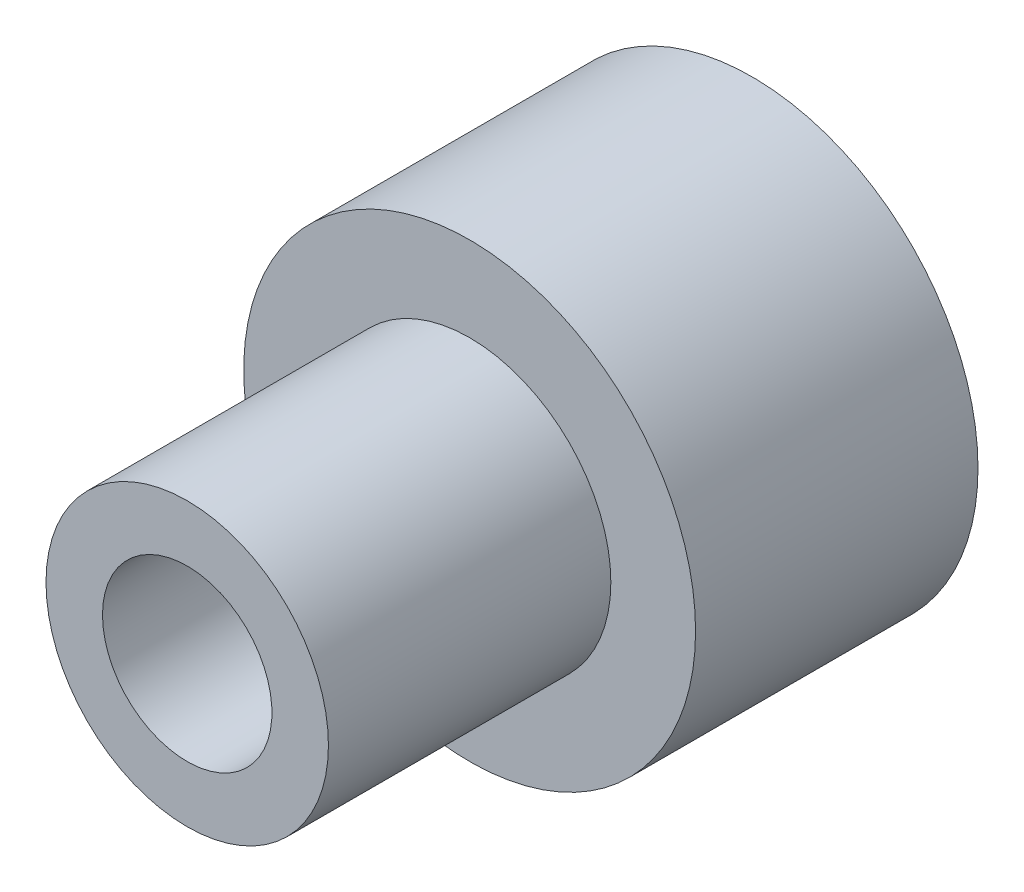
ISO-10303-21;
HEADER;
FILE_DESCRIPTION(('STEP AP214'),'2;1');
FILE_NAME('part.step','',(''),(''),'','','');
FILE_SCHEMA(('AUTOMOTIVE_DESIGN { 1 0 10303 214 1 1 1 1 }'));
ENDSEC;
DATA;
#1=APPLICATION_CONTEXT('core data for automotive mechanical design processes');
#2=APPLICATION_PROTOCOL_DEFINITION('international standard','automotive_design',2000,#1);
#3=PRODUCT_CONTEXT('',#1,'mechanical');
#4=PRODUCT('Part','Part','',(#3));
#5=PRODUCT_RELATED_PRODUCT_CATEGORY('part','',(#4));
#6=PRODUCT_DEFINITION_FORMATION('','',#4);
#7=PRODUCT_DEFINITION_CONTEXT('part definition',#1,'design');
#8=PRODUCT_DEFINITION('design','',#6,#7);
#9=PRODUCT_DEFINITION_SHAPE('','',#8);
#10=(LENGTH_UNIT() NAMED_UNIT(*) SI_UNIT(.MILLI.,.METRE.));
#11=(NAMED_UNIT(*) PLANE_ANGLE_UNIT() SI_UNIT($,.RADIAN.));
#12=(NAMED_UNIT(*) SI_UNIT($,.STERADIAN.) SOLID_ANGLE_UNIT());
#13=UNCERTAINTY_MEASURE_WITH_UNIT(LENGTH_MEASURE(1.E-05),#10,'distance_accuracy_value','');
#14=(GEOMETRIC_REPRESENTATION_CONTEXT(3) GLOBAL_UNCERTAINTY_ASSIGNED_CONTEXT((#13)) GLOBAL_UNIT_ASSIGNED_CONTEXT((#10,
#11,#12)) REPRESENTATION_CONTEXT('',''));
#15=CARTESIAN_POINT('',(0.,0.,0.));
#16=DIRECTION('',(0.,0.,1.));
#17=DIRECTION('',(1.,0.,0.));
#18=AXIS2_PLACEMENT_3D('',#15,#16,#17);
#19=CARTESIAN_POINT('',(0.,0.,5.));
#20=DIRECTION('',(0.,0.,-1.));
#21=DIRECTION('',(-1.,0.,0.));
#22=AXIS2_PLACEMENT_3D('',#19,#20,#21);
#23=CYLINDRICAL_SURFACE('',#22,4.);
#24=CARTESIAN_POINT('',(0.,0.,5.));
#25=DIRECTION('',(0.,0.,1.));
#26=DIRECTION('',(1.,0.,0.));
#27=AXIS2_PLACEMENT_3D('',#24,#25,#26);
#28=CIRCLE('',#27,4.);
#29=CARTESIAN_POINT('',(4.,0.,5.));
#30=VERTEX_POINT('',#29);
#31=EDGE_CURVE('E38',#30,#30,#28,.T.);
#32=ORIENTED_EDGE('',*,*,#31,.F.);
#33=EDGE_LOOP('',(#32));
#34=FACE_BOUND('',#33,.T.);
#35=CARTESIAN_POINT('',(0.,0.,0.));
#36=DIRECTION('',(0.,0.,1.));
#37=DIRECTION('',(1.,0.,0.));
#38=AXIS2_PLACEMENT_3D('',#35,#36,#37);
#39=CIRCLE('',#38,4.);
#40=CARTESIAN_POINT('',(4.,0.,0.));
#41=VERTEX_POINT('',#40);
#42=EDGE_CURVE('E34',#41,#41,#39,.T.);
#43=ORIENTED_EDGE('',*,*,#42,.T.);
#44=EDGE_LOOP('',(#43));
#45=FACE_BOUND('',#44,.T.);
#46=ADVANCED_FACE('F31',(#34,#45),#23,.T.);
#47=CARTESIAN_POINT('',(0.,0.,5.));
#48=DIRECTION('',(0.,0.,1.));
#49=DIRECTION('',(1.,0.,0.));
#50=AXIS2_PLACEMENT_3D('',#47,#48,#49);
#51=PLANE('',#50);
#52=CARTESIAN_POINT('',(0.,0.,5.));
#53=DIRECTION('',(0.,0.,1.));
#54=DIRECTION('',(1.,0.,0.));
#55=AXIS2_PLACEMENT_3D('',#52,#53,#54);
#56=CIRCLE('',#55,2.5);
#57=CARTESIAN_POINT('',(2.5,0.,5.));
#58=VERTEX_POINT('',#57);
#59=EDGE_CURVE('E10',#58,#58,#56,.T.);
#60=ORIENTED_EDGE('',*,*,#59,.F.);
#61=EDGE_LOOP('',(#60));
#62=FACE_BOUND('',#61,.T.);
#63=ORIENTED_EDGE('',*,*,#31,.T.);
#64=EDGE_LOOP('',(#63));
#65=FACE_BOUND('',#64,.T.);
#66=ADVANCED_FACE('F67',(#62,#65),#51,.T.);
#67=CARTESIAN_POINT('',(0.,0.,0.));
#68=DIRECTION('',(0.,0.,1.));
#69=DIRECTION('',(1.,0.,0.));
#70=AXIS2_PLACEMENT_3D('',#67,#68,#69);
#71=PLANE('',#70);
#72=CARTESIAN_POINT('',(0.,0.,0.));
#73=DIRECTION('',(0.,0.,-1.));
#74=DIRECTION('',(-1.,0.,0.));
#75=AXIS2_PLACEMENT_3D('',#72,#73,#74);
#76=CIRCLE('',#75,1.5);
#77=CARTESIAN_POINT('',(-1.5,0.,0.));
#78=VERTEX_POINT('',#77);
#79=EDGE_CURVE('E48',#78,#78,#76,.T.);
#80=ORIENTED_EDGE('',*,*,#79,.F.);
#81=EDGE_LOOP('',(#80));
#82=FACE_BOUND('',#81,.T.);
#83=ORIENTED_EDGE('',*,*,#42,.F.);
#84=EDGE_LOOP('',(#83));
#85=FACE_BOUND('',#84,.T.);
#86=ADVANCED_FACE('F63',(#82,#85),#71,.F.);
#87=CARTESIAN_POINT('',(0.,0.,10.));
#88=DIRECTION('',(0.,0.,-1.));
#89=DIRECTION('',(-1.,0.,0.));
#90=AXIS2_PLACEMENT_3D('',#87,#88,#89);
#91=CYLINDRICAL_SURFACE('',#90,2.5);
#92=CARTESIAN_POINT('',(0.,0.,10.));
#93=DIRECTION('',(0.,0.,1.));
#94=DIRECTION('',(1.,0.,0.));
#95=AXIS2_PLACEMENT_3D('',#92,#93,#94);
#96=CIRCLE('',#95,2.5);
#97=CARTESIAN_POINT('',(2.5,0.,10.));
#98=VERTEX_POINT('',#97);
#99=EDGE_CURVE('E44',#98,#98,#96,.T.);
#100=ORIENTED_EDGE('',*,*,#99,.F.);
#101=EDGE_LOOP('',(#100));
#102=FACE_BOUND('',#101,.T.);
#103=ORIENTED_EDGE('',*,*,#59,.T.);
#104=EDGE_LOOP('',(#103));
#105=FACE_BOUND('',#104,.T.);
#106=ADVANCED_FACE('F66',(#102,#105),#91,.T.);
#107=CARTESIAN_POINT('',(0.,0.,10.));
#108=DIRECTION('',(0.,0.,1.));
#109=DIRECTION('',(1.,0.,0.));
#110=AXIS2_PLACEMENT_3D('',#107,#108,#109);
#111=PLANE('',#110);
#112=CARTESIAN_POINT('',(0.,0.,10.));
#113=DIRECTION('',(0.,0.,-1.));
#114=DIRECTION('',(-1.,0.,0.));
#115=AXIS2_PLACEMENT_3D('',#112,#113,#114);
#116=CIRCLE('',#115,1.5);
#117=CARTESIAN_POINT('',(-1.5,0.,10.));
#118=VERTEX_POINT('',#117);
#119=EDGE_CURVE('E47',#118,#118,#116,.T.);
#120=ORIENTED_EDGE('',*,*,#119,.T.);
#121=EDGE_LOOP('',(#120));
#122=FACE_BOUND('',#121,.T.);
#123=ORIENTED_EDGE('',*,*,#99,.T.);
#124=EDGE_LOOP('',(#123));
#125=FACE_BOUND('',#124,.T.);
#126=ADVANCED_FACE('F54',(#122,#125),#111,.T.);
#127=CARTESIAN_POINT('',(0.,0.,10.));
#128=DIRECTION('',(0.,0.,-1.));
#129=DIRECTION('',(-1.,0.,0.));
#130=AXIS2_PLACEMENT_3D('',#127,#128,#129);
#131=CYLINDRICAL_SURFACE('',#130,1.5);
#132=ORIENTED_EDGE('',*,*,#119,.F.);
#133=EDGE_LOOP('',(#132));
#134=FACE_BOUND('',#133,.T.);
#135=ORIENTED_EDGE('',*,*,#79,.T.);
#136=EDGE_LOOP('',(#135));
#137=FACE_BOUND('',#136,.T.);
#138=ADVANCED_FACE('F57',(#134,#137),#131,.F.);
#139=CLOSED_SHELL('',(#46,#66,#86,#106,#126,#138));
#140=MANIFOLD_SOLID_BREP('B2',#139);
#141=ADVANCED_BREP_SHAPE_REPRESENTATION('',(#18,#140),#14);
#142=SHAPE_DEFINITION_REPRESENTATION(#9,#141);
ENDSEC;
END-ISO-10303-21;
